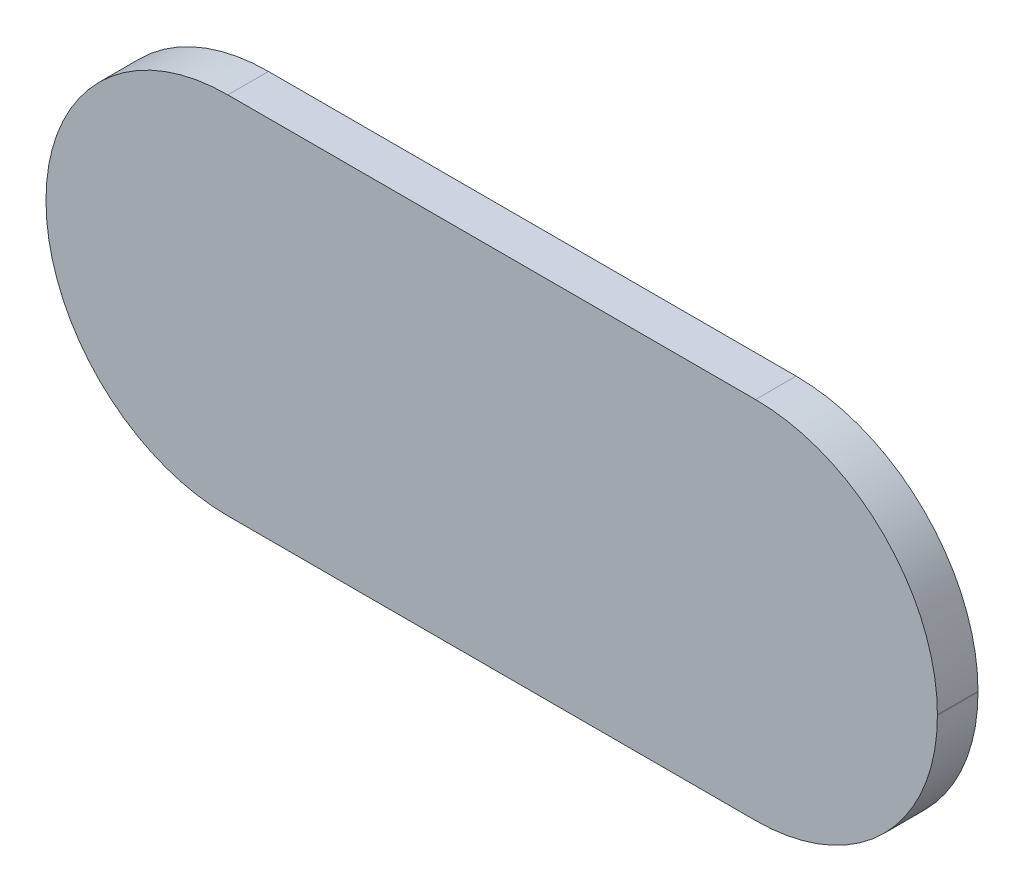
ISO-10303-21;
HEADER;
FILE_DESCRIPTION(('STEP AP214'),'2;1');
FILE_NAME('part.step','',(''),(''),'','','');
FILE_SCHEMA(('AUTOMOTIVE_DESIGN { 1 0 10303 214 1 1 1 1 }'));
ENDSEC;
DATA;
#1=APPLICATION_CONTEXT('core data for automotive mechanical design processes');
#2=APPLICATION_PROTOCOL_DEFINITION('international standard','automotive_design',2000,#1);
#3=PRODUCT_CONTEXT('',#1,'mechanical');
#4=PRODUCT('Part','Part','',(#3));
#5=PRODUCT_RELATED_PRODUCT_CATEGORY('part','',(#4));
#6=PRODUCT_DEFINITION_FORMATION('','',#4);
#7=PRODUCT_DEFINITION_CONTEXT('part definition',#1,'design');
#8=PRODUCT_DEFINITION('design','',#6,#7);
#9=PRODUCT_DEFINITION_SHAPE('','',#8);
#10=(LENGTH_UNIT() NAMED_UNIT(*) SI_UNIT(.MILLI.,.METRE.));
#11=(NAMED_UNIT(*) PLANE_ANGLE_UNIT() SI_UNIT($,.RADIAN.));
#12=(NAMED_UNIT(*) SI_UNIT($,.STERADIAN.) SOLID_ANGLE_UNIT());
#13=UNCERTAINTY_MEASURE_WITH_UNIT(LENGTH_MEASURE(1.E-05),#10,'distance_accuracy_value','');
#14=(GEOMETRIC_REPRESENTATION_CONTEXT(3) GLOBAL_UNCERTAINTY_ASSIGNED_CONTEXT((#13)) GLOBAL_UNIT_ASSIGNED_CONTEXT((#10,
#11,#12)) REPRESENTATION_CONTEXT('',''));
#15=CARTESIAN_POINT('',(0.,0.,0.));
#16=DIRECTION('',(0.,0.,1.));
#17=DIRECTION('',(1.,0.,0.));
#18=AXIS2_PLACEMENT_3D('',#15,#16,#17);
#19=CARTESIAN_POINT('',(-3.04999898,2.24556066,0.));
#20=DIRECTION('',(0.,0.,1.));
#21=DIRECTION('',(1.,0.,0.));
#22=AXIS2_PLACEMENT_3D('',#19,#20,#21);
#23=PLANE('',#22);
#24=CARTESIAN_POINT('',(5.68999938,-0.00556066000000077,0.));
#25=DIRECTION('',(0.,0.,1.));
#26=DIRECTION('',(1.,0.,0.));
#27=AXIS2_PLACEMENT_3D('',#24,#25,#26);
#28=CIRCLE('',#27,2.24);
#29=CARTESIAN_POINT('',(5.68999938,-2.24556066,0.));
#30=VERTEX_POINT('',#29);
#31=CARTESIAN_POINT('',(7.92999938,-0.00556066000000077,0.));
#32=VERTEX_POINT('',#31);
#33=EDGE_CURVE('E127',#30,#32,#28,.T.);
#34=ORIENTED_EDGE('',*,*,#33,.F.);
#35=DIRECTION('',(1.,0.,0.));
#36=VECTOR('',#35,1.);
#37=CARTESIAN_POINT('',(7.92999938,-2.24556066,0.));
#38=LINE('',#37,#36);
#39=CARTESIAN_POINT('',(-0.809998980000001,-2.24556066,0.));
#40=VERTEX_POINT('',#39);
#41=EDGE_CURVE('E110',#40,#30,#38,.T.);
#42=ORIENTED_EDGE('',*,*,#41,.F.);
#43=CARTESIAN_POINT('',(-0.80999898,-0.00556066000000077,0.));
#44=DIRECTION('',(0.,0.,1.));
#45=DIRECTION('',(1.,0.,0.));
#46=AXIS2_PLACEMENT_3D('',#43,#44,#45);
#47=CIRCLE('',#46,2.24);
#48=CARTESIAN_POINT('',(-3.04999898,-0.00556065999999904,0.));
#49=VERTEX_POINT('',#48);
#50=EDGE_CURVE('E113',#49,#40,#47,.T.);
#51=ORIENTED_EDGE('',*,*,#50,.F.);
#52=DIRECTION('',(0.,1.,0.));
#53=VECTOR('',#52,1.);
#54=CARTESIAN_POINT('',(-3.04999898,-2.24556066,0.));
#55=LINE('',#54,#53);
#56=CARTESIAN_POINT('',(-3.04999898,0.00556066000000077,0.));
#57=VERTEX_POINT('',#56);
#58=EDGE_CURVE('E114',#57,#49,#55,.F.);
#59=ORIENTED_EDGE('',*,*,#58,.F.);
#60=CARTESIAN_POINT('',(-0.80999898,0.00556066000000077,0.));
#61=DIRECTION('',(0.,0.,1.));
#62=DIRECTION('',(1.,0.,0.));
#63=AXIS2_PLACEMENT_3D('',#60,#61,#62);
#64=CIRCLE('',#63,2.24);
#65=CARTESIAN_POINT('',(-0.80999898,2.24556066,0.));
#66=VERTEX_POINT('',#65);
#67=EDGE_CURVE('E88',#66,#57,#64,.T.);
#68=ORIENTED_EDGE('',*,*,#67,.F.);
#69=DIRECTION('',(1.,0.,0.));
#70=VECTOR('',#69,1.);
#71=CARTESIAN_POINT('',(-3.04999898,2.24556066,0.));
#72=LINE('',#71,#70);
#73=CARTESIAN_POINT('',(5.68999938,2.24556066,0.));
#74=VERTEX_POINT('',#73);
#75=EDGE_CURVE('E83',#74,#66,#72,.F.);
#76=ORIENTED_EDGE('',*,*,#75,.F.);
#77=CARTESIAN_POINT('',(5.68999938,0.00556066000000077,0.));
#78=DIRECTION('',(0.,0.,1.));
#79=DIRECTION('',(1.,0.,0.));
#80=AXIS2_PLACEMENT_3D('',#77,#78,#79);
#81=CIRCLE('',#80,2.24);
#82=CARTESIAN_POINT('',(7.92999938,0.00556066000000077,0.));
#83=VERTEX_POINT('',#82);
#84=EDGE_CURVE('E20',#83,#74,#81,.T.);
#85=ORIENTED_EDGE('',*,*,#84,.F.);
#86=DIRECTION('',(0.,1.,0.));
#87=VECTOR('',#86,1.);
#88=CARTESIAN_POINT('',(7.92999938,2.24556066,0.));
#89=LINE('',#88,#87);
#90=EDGE_CURVE('E78',#32,#83,#89,.T.);
#91=ORIENTED_EDGE('',*,*,#90,.F.);
#92=EDGE_LOOP('',(#34,#42,#51,#59,#68,#76,#85,#91));
#93=FACE_BOUND('',#92,.T.);
#94=ADVANCED_FACE('F17',(#93),#23,.F.);
#95=CARTESIAN_POINT('',(7.92999938,2.24556066,0.));
#96=DIRECTION('',(1.,0.,0.));
#97=DIRECTION('',(0.,0.,-1.));
#98=AXIS2_PLACEMENT_3D('',#95,#96,#97);
#99=PLANE('',#98);
#100=DIRECTION('',(0.,1.,0.));
#101=VECTOR('',#100,1.);
#102=CARTESIAN_POINT('',(7.92999938,2.24556066,0.499999));
#103=LINE('',#102,#101);
#104=CARTESIAN_POINT('',(7.92999938,-0.00556066000000077,0.499999));
#105=VERTEX_POINT('',#104);
#106=CARTESIAN_POINT('',(7.92999938,0.00556066000000077,0.499999));
#107=VERTEX_POINT('',#106);
#108=EDGE_CURVE('E126',#105,#107,#103,.T.);
#109=ORIENTED_EDGE('',*,*,#108,.F.);
#110=DIRECTION('',(0.,0.,1.));
#111=VECTOR('',#110,1.);
#112=CARTESIAN_POINT('',(7.92999938,-0.00556066000000077,0.));
#113=LINE('',#112,#111);
#114=EDGE_CURVE('E130',#32,#105,#113,.T.);
#115=ORIENTED_EDGE('',*,*,#114,.F.);
#116=ORIENTED_EDGE('',*,*,#90,.T.);
#117=DIRECTION('',(0.,0.,1.));
#118=VECTOR('',#117,1.);
#119=CARTESIAN_POINT('',(7.92999938,0.00556066000000077,0.));
#120=LINE('',#119,#118);
#121=EDGE_CURVE('E98',#107,#83,#120,.F.);
#122=ORIENTED_EDGE('',*,*,#121,.F.);
#123=EDGE_LOOP('',(#109,#115,#116,#122));
#124=FACE_BOUND('',#123,.T.);
#125=ADVANCED_FACE('F163',(#124),#99,.T.);
#126=CARTESIAN_POINT('',(5.68999938,0.00556066000000077,0.));
#127=DIRECTION('',(0.,0.,1.));
#128=DIRECTION('',(1.,0.,0.));
#129=AXIS2_PLACEMENT_3D('',#126,#127,#128);
#130=CYLINDRICAL_SURFACE('',#129,2.24);
#131=DIRECTION('',(0.,0.,1.));
#132=VECTOR('',#131,1.);
#133=CARTESIAN_POINT('',(5.68999938,2.24556066,0.));
#134=LINE('',#133,#132);
#135=CARTESIAN_POINT('',(5.68999938,2.24556066,0.499999));
#136=VERTEX_POINT('',#135);
#137=EDGE_CURVE('E92',#136,#74,#134,.F.);
#138=ORIENTED_EDGE('',*,*,#137,.F.);
#139=CARTESIAN_POINT('',(5.68999938,0.00556066000000077,0.499999));
#140=DIRECTION('',(0.,0.,1.));
#141=DIRECTION('',(1.,0.,0.));
#142=AXIS2_PLACEMENT_3D('',#139,#140,#141);
#143=CIRCLE('',#142,2.24);
#144=EDGE_CURVE('E124',#107,#136,#143,.T.);
#145=ORIENTED_EDGE('',*,*,#144,.F.);
#146=ORIENTED_EDGE('',*,*,#121,.T.);
#147=ORIENTED_EDGE('',*,*,#84,.T.);
#148=EDGE_LOOP('',(#138,#145,#146,#147));
#149=FACE_BOUND('',#148,.T.);
#150=ADVANCED_FACE('F95',(#149),#130,.T.);
#151=CARTESIAN_POINT('',(-3.04999898,2.24556066,0.));
#152=DIRECTION('',(0.,1.,0.));
#153=DIRECTION('',(0.,0.,1.));
#154=AXIS2_PLACEMENT_3D('',#151,#152,#153);
#155=PLANE('',#154);
#156=DIRECTION('',(1.,0.,0.));
#157=VECTOR('',#156,1.);
#158=CARTESIAN_POINT('',(-3.04999898,2.24556066,0.499999));
#159=LINE('',#158,#157);
#160=CARTESIAN_POINT('',(-0.80999898,2.24556066,0.499999));
#161=VERTEX_POINT('',#160);
#162=EDGE_CURVE('E101',#136,#161,#159,.F.);
#163=ORIENTED_EDGE('',*,*,#162,.F.);
#164=ORIENTED_EDGE('',*,*,#137,.T.);
#165=ORIENTED_EDGE('',*,*,#75,.T.);
#166=DIRECTION('',(0.,0.,1.));
#167=VECTOR('',#166,1.);
#168=CARTESIAN_POINT('',(-0.80999898,2.24556066,0.));
#169=LINE('',#168,#167);
#170=EDGE_CURVE('E103',#161,#66,#169,.F.);
#171=ORIENTED_EDGE('',*,*,#170,.F.);
#172=EDGE_LOOP('',(#163,#164,#165,#171));
#173=FACE_BOUND('',#172,.T.);
#174=ADVANCED_FACE('F99',(#173),#155,.T.);
#175=CARTESIAN_POINT('',(-0.80999898,0.00556066000000077,0.));
#176=DIRECTION('',(0.,0.,1.));
#177=DIRECTION('',(1.,0.,0.));
#178=AXIS2_PLACEMENT_3D('',#175,#176,#177);
#179=CYLINDRICAL_SURFACE('',#178,2.24);
#180=ORIENTED_EDGE('',*,*,#67,.T.);
#181=DIRECTION('',(0.,0.,1.));
#182=VECTOR('',#181,1.);
#183=CARTESIAN_POINT('',(-3.04999898,0.00556066000000077,0.));
#184=LINE('',#183,#182);
#185=CARTESIAN_POINT('',(-3.04999898,0.00556066000000077,0.499999));
#186=VERTEX_POINT('',#185);
#187=EDGE_CURVE('E115',#186,#57,#184,.F.);
#188=ORIENTED_EDGE('',*,*,#187,.F.);
#189=CARTESIAN_POINT('',(-0.80999898,0.00556066000000077,0.499999));
#190=DIRECTION('',(0.,0.,1.));
#191=DIRECTION('',(1.,0.,0.));
#192=AXIS2_PLACEMENT_3D('',#189,#190,#191);
#193=CIRCLE('',#192,2.24);
#194=EDGE_CURVE('E121',#161,#186,#193,.T.);
#195=ORIENTED_EDGE('',*,*,#194,.F.);
#196=ORIENTED_EDGE('',*,*,#170,.T.);
#197=EDGE_LOOP('',(#180,#188,#195,#196));
#198=FACE_BOUND('',#197,.T.);
#199=ADVANCED_FACE('F135',(#198),#179,.T.);
#200=CARTESIAN_POINT('',(-3.04999898,-2.24556066,0.));
#201=DIRECTION('',(-1.,0.,0.));
#202=DIRECTION('',(0.,0.,1.));
#203=AXIS2_PLACEMENT_3D('',#200,#201,#202);
#204=PLANE('',#203);
#205=DIRECTION('',(0.,1.,0.));
#206=VECTOR('',#205,1.);
#207=CARTESIAN_POINT('',(-3.04999898,2.24556066,0.499999));
#208=LINE('',#207,#206);
#209=CARTESIAN_POINT('',(-3.04999898,-0.00556065999999904,0.499999));
#210=VERTEX_POINT('',#209);
#211=EDGE_CURVE('E120',#186,#210,#208,.F.);
#212=ORIENTED_EDGE('',*,*,#211,.F.);
#213=ORIENTED_EDGE('',*,*,#187,.T.);
#214=ORIENTED_EDGE('',*,*,#58,.T.);
#215=DIRECTION('',(0.,0.,1.));
#216=VECTOR('',#215,1.);
#217=CARTESIAN_POINT('',(-3.04999898,-0.00556065999999904,0.));
#218=LINE('',#217,#216);
#219=EDGE_CURVE('E132',#210,#49,#218,.F.);
#220=ORIENTED_EDGE('',*,*,#219,.F.);
#221=EDGE_LOOP('',(#212,#213,#214,#220));
#222=FACE_BOUND('',#221,.T.);
#223=ADVANCED_FACE('F139',(#222),#204,.T.);
#224=CARTESIAN_POINT('',(-0.80999898,-0.00556066000000077,0.));
#225=DIRECTION('',(0.,0.,1.));
#226=DIRECTION('',(1.,0.,0.));
#227=AXIS2_PLACEMENT_3D('',#224,#225,#226);
#228=CYLINDRICAL_SURFACE('',#227,2.24);
#229=DIRECTION('',(0.,0.,-1.));
#230=VECTOR('',#229,1.);
#231=CARTESIAN_POINT('',(-0.809998980000001,-2.24556066,0.));
#232=LINE('',#231,#230);
#233=CARTESIAN_POINT('',(-0.809998980000001,-2.24556066,0.499999));
#234=VERTEX_POINT('',#233);
#235=EDGE_CURVE('E112',#234,#40,#232,.T.);
#236=ORIENTED_EDGE('',*,*,#235,.F.);
#237=CARTESIAN_POINT('',(-0.80999898,-0.00556066000000077,0.499999));
#238=DIRECTION('',(0.,0.,1.));
#239=DIRECTION('',(1.,0.,0.));
#240=AXIS2_PLACEMENT_3D('',#237,#238,#239);
#241=CIRCLE('',#240,2.24);
#242=EDGE_CURVE('E117',#210,#234,#241,.T.);
#243=ORIENTED_EDGE('',*,*,#242,.F.);
#244=ORIENTED_EDGE('',*,*,#219,.T.);
#245=ORIENTED_EDGE('',*,*,#50,.T.);
#246=EDGE_LOOP('',(#236,#243,#244,#245));
#247=FACE_BOUND('',#246,.T.);
#248=ADVANCED_FACE('F160',(#247),#228,.T.);
#249=CARTESIAN_POINT('',(7.92999938,-2.24556066,0.));
#250=DIRECTION('',(0.,-1.,0.));
#251=DIRECTION('',(0.,0.,-1.));
#252=AXIS2_PLACEMENT_3D('',#249,#250,#251);
#253=PLANE('',#252);
#254=DIRECTION('',(1.,0.,0.));
#255=VECTOR('',#254,1.);
#256=CARTESIAN_POINT('',(-3.04999898,-2.24556066,0.499999));
#257=LINE('',#256,#255);
#258=CARTESIAN_POINT('',(5.68999938,-2.24556066,0.499999));
#259=VERTEX_POINT('',#258);
#260=EDGE_CURVE('E26',#234,#259,#257,.T.);
#261=ORIENTED_EDGE('',*,*,#260,.F.);
#262=ORIENTED_EDGE('',*,*,#235,.T.);
#263=ORIENTED_EDGE('',*,*,#41,.T.);
#264=DIRECTION('',(0.,0.,1.));
#265=VECTOR('',#264,1.);
#266=CARTESIAN_POINT('',(5.68999938,-2.24556066,0.));
#267=LINE('',#266,#265);
#268=EDGE_CURVE('E35',#259,#30,#267,.F.);
#269=ORIENTED_EDGE('',*,*,#268,.F.);
#270=EDGE_LOOP('',(#261,#262,#263,#269));
#271=FACE_BOUND('',#270,.T.);
#272=ADVANCED_FACE('F158',(#271),#253,.T.);
#273=CARTESIAN_POINT('',(5.68999938,-0.00556066000000077,0.));
#274=DIRECTION('',(0.,0.,1.));
#275=DIRECTION('',(1.,0.,0.));
#276=AXIS2_PLACEMENT_3D('',#273,#274,#275);
#277=CYLINDRICAL_SURFACE('',#276,2.24);
#278=ORIENTED_EDGE('',*,*,#114,.T.);
#279=CARTESIAN_POINT('',(5.68999938,-0.00556066000000077,0.499999));
#280=DIRECTION('',(0.,0.,1.));
#281=DIRECTION('',(1.,0.,0.));
#282=AXIS2_PLACEMENT_3D('',#279,#280,#281);
#283=CIRCLE('',#282,2.24);
#284=EDGE_CURVE('E11',#259,#105,#283,.T.);
#285=ORIENTED_EDGE('',*,*,#284,.F.);
#286=ORIENTED_EDGE('',*,*,#268,.T.);
#287=ORIENTED_EDGE('',*,*,#33,.T.);
#288=EDGE_LOOP('',(#278,#285,#286,#287));
#289=FACE_BOUND('',#288,.T.);
#290=ADVANCED_FACE('F162',(#289),#277,.T.);
#291=CARTESIAN_POINT('',(-3.04999898,2.24556066,0.499999));
#292=DIRECTION('',(0.,0.,1.));
#293=DIRECTION('',(1.,0.,0.));
#294=AXIS2_PLACEMENT_3D('',#291,#292,#293);
#295=PLANE('',#294);
#296=ORIENTED_EDGE('',*,*,#260,.T.);
#297=ORIENTED_EDGE('',*,*,#284,.T.);
#298=ORIENTED_EDGE('',*,*,#108,.T.);
#299=ORIENTED_EDGE('',*,*,#144,.T.);
#300=ORIENTED_EDGE('',*,*,#162,.T.);
#301=ORIENTED_EDGE('',*,*,#194,.T.);
#302=ORIENTED_EDGE('',*,*,#211,.T.);
#303=ORIENTED_EDGE('',*,*,#242,.T.);
#304=EDGE_LOOP('',(#296,#297,#298,#299,#300,#301,#302,#303));
#305=FACE_BOUND('',#304,.T.);
#306=ADVANCED_FACE('F156',(#305),#295,.T.);
#307=CLOSED_SHELL('',(#94,#125,#150,#174,#199,#223,#248,#272,#290,#306));
#308=MANIFOLD_SOLID_BREP('B1',#307);
#309=ADVANCED_BREP_SHAPE_REPRESENTATION('',(#18,#308),#14);
#310=SHAPE_DEFINITION_REPRESENTATION(#9,#309);
ENDSEC;
END-ISO-10303-21;
